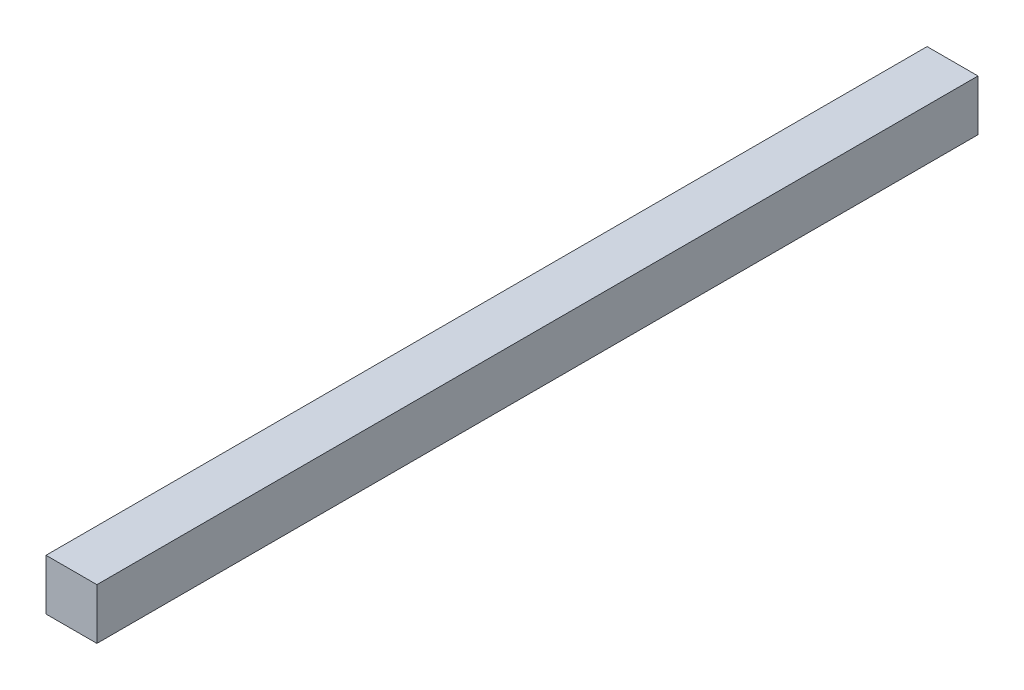
ISO-10303-21;
HEADER;
FILE_DESCRIPTION(('STEP AP214'),'2;1');
FILE_NAME('part.step','',(''),(''),'','','');
FILE_SCHEMA(('AUTOMOTIVE_DESIGN { 1 0 10303 214 1 1 1 1 }'));
ENDSEC;
DATA;
#1=APPLICATION_CONTEXT('core data for automotive mechanical design processes');
#2=APPLICATION_PROTOCOL_DEFINITION('international standard','automotive_design',2000,#1);
#3=PRODUCT_CONTEXT('',#1,'mechanical');
#4=PRODUCT('Part','Part','',(#3));
#5=PRODUCT_RELATED_PRODUCT_CATEGORY('part','',(#4));
#6=PRODUCT_DEFINITION_FORMATION('','',#4);
#7=PRODUCT_DEFINITION_CONTEXT('part definition',#1,'design');
#8=PRODUCT_DEFINITION('design','',#6,#7);
#9=PRODUCT_DEFINITION_SHAPE('','',#8);
#10=(LENGTH_UNIT() NAMED_UNIT(*) SI_UNIT(.MILLI.,.METRE.));
#11=(NAMED_UNIT(*) PLANE_ANGLE_UNIT() SI_UNIT($,.RADIAN.));
#12=(NAMED_UNIT(*) SI_UNIT($,.STERADIAN.) SOLID_ANGLE_UNIT());
#13=UNCERTAINTY_MEASURE_WITH_UNIT(LENGTH_MEASURE(1.E-05),#10,'distance_accuracy_value','');
#14=(GEOMETRIC_REPRESENTATION_CONTEXT(3) GLOBAL_UNCERTAINTY_ASSIGNED_CONTEXT((#13)) GLOBAL_UNIT_ASSIGNED_CONTEXT((#10,
#11,#12)) REPRESENTATION_CONTEXT('',''));
#15=CARTESIAN_POINT('',(0.,0.,0.));
#16=DIRECTION('',(0.,0.,1.));
#17=DIRECTION('',(1.,0.,0.));
#18=AXIS2_PLACEMENT_3D('',#15,#16,#17);
#19=CARTESIAN_POINT('',(-1.27,12.25,-8.25));
#20=DIRECTION('',(0.,0.,-1.));
#21=DIRECTION('',(0.,-1.,0.));
#22=AXIS2_PLACEMENT_3D('',#19,#20,#21);
#23=PLANE('',#22);
#24=DIRECTION('',(-1.,0.,0.));
#25=VECTOR('',#24,1.);
#26=CARTESIAN_POINT('',(-0.945,11.925,-8.25));
#27=LINE('',#26,#25);
#28=CARTESIAN_POINT('',(-0.945,11.925,-8.25));
#29=VERTEX_POINT('',#28);
#30=CARTESIAN_POINT('',(-1.595,11.925,-8.25));
#31=VERTEX_POINT('',#30);
#32=EDGE_CURVE('E11',#29,#31,#27,.T.);
#33=ORIENTED_EDGE('',*,*,#32,.T.);
#34=DIRECTION('',(0.,1.,0.));
#35=VECTOR('',#34,1.);
#36=CARTESIAN_POINT('',(-1.595,11.925,-8.25));
#37=LINE('',#36,#35);
#38=CARTESIAN_POINT('',(-1.595,12.575,-8.25));
#39=VERTEX_POINT('',#38);
#40=EDGE_CURVE('E27',#31,#39,#37,.T.);
#41=ORIENTED_EDGE('',*,*,#40,.T.);
#42=DIRECTION('',(1.,0.,0.));
#43=VECTOR('',#42,1.);
#44=CARTESIAN_POINT('',(-1.595,12.575,-8.25));
#45=LINE('',#44,#43);
#46=CARTESIAN_POINT('',(-0.945,12.575,-8.25));
#47=VERTEX_POINT('',#46);
#48=EDGE_CURVE('E69',#39,#47,#45,.T.);
#49=ORIENTED_EDGE('',*,*,#48,.T.);
#50=DIRECTION('',(0.,-1.,0.));
#51=VECTOR('',#50,1.);
#52=CARTESIAN_POINT('',(-0.945,12.575,-8.25));
#53=LINE('',#52,#51);
#54=EDGE_CURVE('E66',#47,#29,#53,.T.);
#55=ORIENTED_EDGE('',*,*,#54,.T.);
#56=EDGE_LOOP('',(#33,#41,#49,#55));
#57=FACE_BOUND('',#56,.T.);
#58=ADVANCED_FACE('F16',(#57),#23,.T.);
#59=CARTESIAN_POINT('',(-1.595,12.575,1.));
#60=DIRECTION('',(-1.,0.,0.));
#61=DIRECTION('',(0.,0.,1.));
#62=AXIS2_PLACEMENT_3D('',#59,#60,#61);
#63=PLANE('',#62);
#64=DIRECTION('',(0.,0.,-1.));
#65=VECTOR('',#64,1.);
#66=CARTESIAN_POINT('',(-1.595,11.925,1.));
#67=LINE('',#66,#65);
#68=CARTESIAN_POINT('',(-1.595,11.925,3.));
#69=VERTEX_POINT('',#68);
#70=EDGE_CURVE('E83',#69,#31,#67,.T.);
#71=ORIENTED_EDGE('',*,*,#70,.F.);
#72=DIRECTION('',(0.,-1.,0.));
#73=VECTOR('',#72,1.);
#74=CARTESIAN_POINT('',(-1.595,11.925,3.));
#75=LINE('',#74,#73);
#76=CARTESIAN_POINT('',(-1.595,12.575,3.));
#77=VERTEX_POINT('',#76);
#78=EDGE_CURVE('E100',#77,#69,#75,.T.);
#79=ORIENTED_EDGE('',*,*,#78,.F.);
#80=DIRECTION('',(0.,0.,1.));
#81=VECTOR('',#80,1.);
#82=CARTESIAN_POINT('',(-1.595,12.575,1.));
#83=LINE('',#82,#81);
#84=EDGE_CURVE('E75',#39,#77,#83,.T.);
#85=ORIENTED_EDGE('',*,*,#84,.F.);
#86=ORIENTED_EDGE('',*,*,#40,.F.);
#87=EDGE_LOOP('',(#71,#79,#85,#86));
#88=FACE_BOUND('',#87,.T.);
#89=ADVANCED_FACE('F18',(#88),#63,.T.);
#90=CARTESIAN_POINT('',(-0.945,12.575,1.));
#91=DIRECTION('',(0.,1.,0.));
#92=DIRECTION('',(1.,0.,0.));
#93=AXIS2_PLACEMENT_3D('',#90,#91,#92);
#94=PLANE('',#93);
#95=ORIENTED_EDGE('',*,*,#84,.T.);
#96=DIRECTION('',(-1.,0.,0.));
#97=VECTOR('',#96,1.);
#98=CARTESIAN_POINT('',(-1.595,12.575,3.));
#99=LINE('',#98,#97);
#100=CARTESIAN_POINT('',(-0.945,12.575,3.));
#101=VERTEX_POINT('',#100);
#102=EDGE_CURVE('E102',#101,#77,#99,.T.);
#103=ORIENTED_EDGE('',*,*,#102,.F.);
#104=DIRECTION('',(0.,0.,1.));
#105=VECTOR('',#104,1.);
#106=CARTESIAN_POINT('',(-0.945,12.575,1.));
#107=LINE('',#106,#105);
#108=EDGE_CURVE('E87',#47,#101,#107,.T.);
#109=ORIENTED_EDGE('',*,*,#108,.F.);
#110=ORIENTED_EDGE('',*,*,#48,.F.);
#111=EDGE_LOOP('',(#95,#103,#109,#110));
#112=FACE_BOUND('',#111,.T.);
#113=ADVANCED_FACE('F115',(#112),#94,.T.);
#114=CARTESIAN_POINT('',(-0.945,11.925,1.));
#115=DIRECTION('',(1.,0.,0.));
#116=DIRECTION('',(0.,1.,0.));
#117=AXIS2_PLACEMENT_3D('',#114,#115,#116);
#118=PLANE('',#117);
#119=ORIENTED_EDGE('',*,*,#108,.T.);
#120=DIRECTION('',(0.,1.,0.));
#121=VECTOR('',#120,1.);
#122=CARTESIAN_POINT('',(-0.945,12.575,3.));
#123=LINE('',#122,#121);
#124=CARTESIAN_POINT('',(-0.945,11.925,3.));
#125=VERTEX_POINT('',#124);
#126=EDGE_CURVE('E20',#125,#101,#123,.T.);
#127=ORIENTED_EDGE('',*,*,#126,.F.);
#128=DIRECTION('',(0.,0.,1.));
#129=VECTOR('',#128,1.);
#130=CARTESIAN_POINT('',(-0.945,11.925,1.));
#131=LINE('',#130,#129);
#132=EDGE_CURVE('E81',#29,#125,#131,.T.);
#133=ORIENTED_EDGE('',*,*,#132,.F.);
#134=ORIENTED_EDGE('',*,*,#54,.F.);
#135=EDGE_LOOP('',(#119,#127,#133,#134));
#136=FACE_BOUND('',#135,.T.);
#137=ADVANCED_FACE('F84',(#136),#118,.T.);
#138=CARTESIAN_POINT('',(-1.595,11.925,1.));
#139=DIRECTION('',(0.,-1.,0.));
#140=DIRECTION('',(0.,0.,-1.));
#141=AXIS2_PLACEMENT_3D('',#138,#139,#140);
#142=PLANE('',#141);
#143=ORIENTED_EDGE('',*,*,#132,.T.);
#144=DIRECTION('',(1.,0.,0.));
#145=VECTOR('',#144,1.);
#146=CARTESIAN_POINT('',(-0.945,11.925,3.));
#147=LINE('',#146,#145);
#148=EDGE_CURVE('E95',#69,#125,#147,.T.);
#149=ORIENTED_EDGE('',*,*,#148,.F.);
#150=ORIENTED_EDGE('',*,*,#70,.T.);
#151=ORIENTED_EDGE('',*,*,#32,.F.);
#152=EDGE_LOOP('',(#143,#149,#150,#151));
#153=FACE_BOUND('',#152,.T.);
#154=ADVANCED_FACE('F79',(#153),#142,.T.);
#155=CARTESIAN_POINT('',(-1.27,12.25,3.));
#156=DIRECTION('',(0.,0.,1.));
#157=DIRECTION('',(1.,0.,0.));
#158=AXIS2_PLACEMENT_3D('',#155,#156,#157);
#159=PLANE('',#158);
#160=ORIENTED_EDGE('',*,*,#148,.T.);
#161=ORIENTED_EDGE('',*,*,#126,.T.);
#162=ORIENTED_EDGE('',*,*,#102,.T.);
#163=ORIENTED_EDGE('',*,*,#78,.T.);
#164=EDGE_LOOP('',(#160,#161,#162,#163));
#165=FACE_BOUND('',#164,.T.);
#166=ADVANCED_FACE('F118',(#165),#159,.T.);
#167=CLOSED_SHELL('',(#58,#89,#113,#137,#154,#166));
#168=MANIFOLD_SOLID_BREP('B1',#167);
#169=ADVANCED_BREP_SHAPE_REPRESENTATION('',(#18,#168),#14);
#170=SHAPE_DEFINITION_REPRESENTATION(#9,#169);
ENDSEC;
END-ISO-10303-21;
